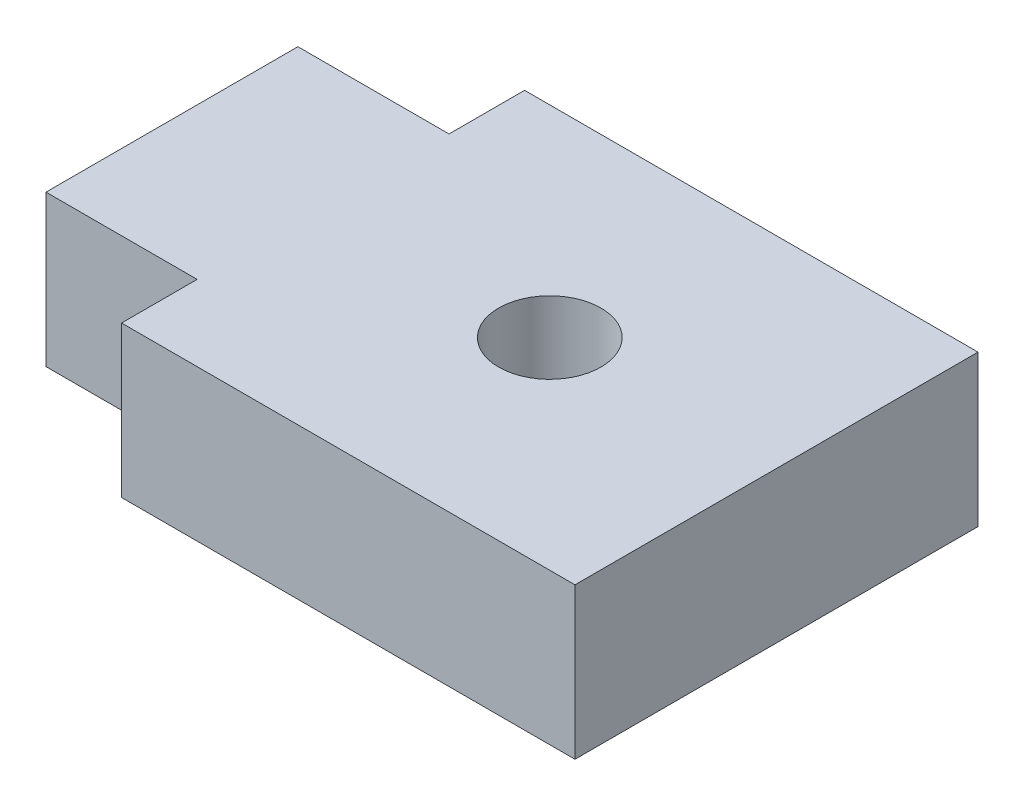
ISO-10303-21;
HEADER;
FILE_DESCRIPTION(('STEP AP214'),'2;1');
FILE_NAME('part.step','',(''),(''),'','','');
FILE_SCHEMA(('AUTOMOTIVE_DESIGN { 1 0 10303 214 1 1 1 1 }'));
ENDSEC;
DATA;
#1=APPLICATION_CONTEXT('core data for automotive mechanical design processes');
#2=APPLICATION_PROTOCOL_DEFINITION('international standard','automotive_design',2000,#1);
#3=PRODUCT_CONTEXT('',#1,'mechanical');
#4=PRODUCT('Part','Part','',(#3));
#5=PRODUCT_RELATED_PRODUCT_CATEGORY('part','',(#4));
#6=PRODUCT_DEFINITION_FORMATION('','',#4);
#7=PRODUCT_DEFINITION_CONTEXT('part definition',#1,'design');
#8=PRODUCT_DEFINITION('design','',#6,#7);
#9=PRODUCT_DEFINITION_SHAPE('','',#8);
#10=(LENGTH_UNIT() NAMED_UNIT(*) SI_UNIT(.MILLI.,.METRE.));
#11=(NAMED_UNIT(*) PLANE_ANGLE_UNIT() SI_UNIT($,.RADIAN.));
#12=(NAMED_UNIT(*) SI_UNIT($,.STERADIAN.) SOLID_ANGLE_UNIT());
#13=UNCERTAINTY_MEASURE_WITH_UNIT(LENGTH_MEASURE(1.E-05),#10,'distance_accuracy_value','');
#14=(GEOMETRIC_REPRESENTATION_CONTEXT(3) GLOBAL_UNCERTAINTY_ASSIGNED_CONTEXT((#13)) GLOBAL_UNIT_ASSIGNED_CONTEXT((#10,
#11,#12)) REPRESENTATION_CONTEXT('',''));
#15=CARTESIAN_POINT('',(0.,0.,0.));
#16=DIRECTION('',(0.,0.,1.));
#17=DIRECTION('',(1.,0.,0.));
#18=AXIS2_PLACEMENT_3D('',#15,#16,#17);
#19=CARTESIAN_POINT('',(-4.5,3.,0.));
#20=DIRECTION('',(-1.,0.,0.));
#21=DIRECTION('',(0.,0.,1.));
#22=AXIS2_PLACEMENT_3D('',#19,#20,#21);
#23=PLANE('',#22);
#24=DIRECTION('',(0.,0.,-1.));
#25=VECTOR('',#24,1.);
#26=CARTESIAN_POINT('',(-4.5,0.,0.));
#27=LINE('',#26,#25);
#28=CARTESIAN_POINT('',(-4.5,0.,-2.5));
#29=VERTEX_POINT('',#28);
#30=CARTESIAN_POINT('',(-4.5,0.,-4.));
#31=VERTEX_POINT('',#30);
#32=EDGE_CURVE('E57',#29,#31,#27,.T.);
#33=ORIENTED_EDGE('',*,*,#32,.F.);
#34=DIRECTION('',(0.,1.,0.));
#35=VECTOR('',#34,1.);
#36=CARTESIAN_POINT('',(-4.5,-5.8309518948453,-2.5));
#37=LINE('',#36,#35);
#38=CARTESIAN_POINT('',(-4.5,3.,-2.5));
#39=VERTEX_POINT('',#38);
#40=EDGE_CURVE('E52',#29,#39,#37,.T.);
#41=ORIENTED_EDGE('',*,*,#40,.T.);
#42=DIRECTION('',(0.,0.,-1.));
#43=VECTOR('',#42,1.);
#44=CARTESIAN_POINT('',(-4.5,3.,0.));
#45=LINE('',#44,#43);
#46=CARTESIAN_POINT('',(-4.5,3.,-4.));
#47=VERTEX_POINT('',#46);
#48=EDGE_CURVE('E124',#39,#47,#45,.T.);
#49=ORIENTED_EDGE('',*,*,#48,.T.);
#50=DIRECTION('',(0.,-1.,0.));
#51=VECTOR('',#50,1.);
#52=CARTESIAN_POINT('',(-4.5,3.,-4.));
#53=LINE('',#52,#51);
#54=EDGE_CURVE('E164',#47,#31,#53,.T.);
#55=ORIENTED_EDGE('',*,*,#54,.T.);
#56=EDGE_LOOP('',(#33,#41,#49,#55));
#57=FACE_BOUND('',#56,.T.);
#58=ADVANCED_FACE('F35',(#57),#23,.T.);
#59=CARTESIAN_POINT('',(0.,3.,4.));
#60=DIRECTION('',(0.,0.,-1.));
#61=DIRECTION('',(-1.,0.,0.));
#62=AXIS2_PLACEMENT_3D('',#59,#60,#61);
#63=PLANE('',#62);
#64=DIRECTION('',(1.,0.,0.));
#65=VECTOR('',#64,1.);
#66=CARTESIAN_POINT('',(0.,0.,4.));
#67=LINE('',#66,#65);
#68=CARTESIAN_POINT('',(-4.5,0.,4.));
#69=VERTEX_POINT('',#68);
#70=CARTESIAN_POINT('',(4.5,0.,4.));
#71=VERTEX_POINT('',#70);
#72=EDGE_CURVE('E147',#69,#71,#67,.T.);
#73=ORIENTED_EDGE('',*,*,#72,.T.);
#74=DIRECTION('',(0.,-1.,0.));
#75=VECTOR('',#74,1.);
#76=CARTESIAN_POINT('',(4.5,3.,4.));
#77=LINE('',#76,#75);
#78=CARTESIAN_POINT('',(4.5,3.,4.));
#79=VERTEX_POINT('',#78);
#80=EDGE_CURVE('E11',#79,#71,#77,.T.);
#81=ORIENTED_EDGE('',*,*,#80,.F.);
#82=DIRECTION('',(1.,0.,0.));
#83=VECTOR('',#82,1.);
#84=CARTESIAN_POINT('',(0.,3.,4.));
#85=LINE('',#84,#83);
#86=CARTESIAN_POINT('',(-4.5,3.,4.));
#87=VERTEX_POINT('',#86);
#88=EDGE_CURVE('E137',#87,#79,#85,.T.);
#89=ORIENTED_EDGE('',*,*,#88,.F.);
#90=DIRECTION('',(0.,-1.,0.));
#91=VECTOR('',#90,1.);
#92=CARTESIAN_POINT('',(-4.5,3.,4.));
#93=LINE('',#92,#91);
#94=EDGE_CURVE('E155',#87,#69,#93,.T.);
#95=ORIENTED_EDGE('',*,*,#94,.T.);
#96=EDGE_LOOP('',(#73,#81,#89,#95));
#97=FACE_BOUND('',#96,.T.);
#98=ADVANCED_FACE('F37',(#97),#63,.F.);
#99=CARTESIAN_POINT('',(4.5,3.,0.));
#100=DIRECTION('',(-1.,0.,0.));
#101=DIRECTION('',(0.,0.,1.));
#102=AXIS2_PLACEMENT_3D('',#99,#100,#101);
#103=PLANE('',#102);
#104=DIRECTION('',(0.,0.,-1.));
#105=VECTOR('',#104,1.);
#106=CARTESIAN_POINT('',(4.5,0.,0.));
#107=LINE('',#106,#105);
#108=CARTESIAN_POINT('',(4.5,0.,-4.));
#109=VERTEX_POINT('',#108);
#110=EDGE_CURVE('E174',#71,#109,#107,.T.);
#111=ORIENTED_EDGE('',*,*,#110,.T.);
#112=DIRECTION('',(0.,-1.,0.));
#113=VECTOR('',#112,1.);
#114=CARTESIAN_POINT('',(4.5,3.,-4.));
#115=LINE('',#114,#113);
#116=CARTESIAN_POINT('',(4.5,3.,-4.));
#117=VERTEX_POINT('',#116);
#118=EDGE_CURVE('E44',#117,#109,#115,.T.);
#119=ORIENTED_EDGE('',*,*,#118,.F.);
#120=DIRECTION('',(0.,0.,-1.));
#121=VECTOR('',#120,1.);
#122=CARTESIAN_POINT('',(4.5,3.,0.));
#123=LINE('',#122,#121);
#124=EDGE_CURVE('E139',#79,#117,#123,.T.);
#125=ORIENTED_EDGE('',*,*,#124,.F.);
#126=ORIENTED_EDGE('',*,*,#80,.T.);
#127=EDGE_LOOP('',(#111,#119,#125,#126));
#128=FACE_BOUND('',#127,.T.);
#129=ADVANCED_FACE('F175',(#128),#103,.F.);
#130=CARTESIAN_POINT('',(0.,3.,-4.));
#131=DIRECTION('',(0.,0.,-1.));
#132=DIRECTION('',(-1.,0.,0.));
#133=AXIS2_PLACEMENT_3D('',#130,#131,#132);
#134=PLANE('',#133);
#135=DIRECTION('',(1.,0.,0.));
#136=VECTOR('',#135,1.);
#137=CARTESIAN_POINT('',(0.,0.,-4.));
#138=LINE('',#137,#136);
#139=EDGE_CURVE('E158',#31,#109,#138,.T.);
#140=ORIENTED_EDGE('',*,*,#139,.F.);
#141=ORIENTED_EDGE('',*,*,#54,.F.);
#142=DIRECTION('',(1.,0.,0.));
#143=VECTOR('',#142,1.);
#144=CARTESIAN_POINT('',(0.,3.,-4.));
#145=LINE('',#144,#143);
#146=EDGE_CURVE('E142',#47,#117,#145,.T.);
#147=ORIENTED_EDGE('',*,*,#146,.T.);
#148=ORIENTED_EDGE('',*,*,#118,.T.);
#149=EDGE_LOOP('',(#140,#141,#147,#148));
#150=FACE_BOUND('',#149,.T.);
#151=ADVANCED_FACE('F170',(#150),#134,.T.);
#152=DIRECTION('',(0.,1.,0.));
#153=VECTOR('',#152,1.);
#154=CARTESIAN_POINT('',(-4.5,-5.8309518948453,2.5));
#155=LINE('',#154,#153);
#156=CARTESIAN_POINT('',(-4.5,0.,2.5));
#157=VERTEX_POINT('',#156);
#158=CARTESIAN_POINT('',(-4.5,3.,2.5));
#159=VERTEX_POINT('',#158);
#160=EDGE_CURVE('E194',#157,#159,#155,.T.);
#161=ORIENTED_EDGE('',*,*,#160,.F.);
#162=EDGE_CURVE('E140',#69,#157,#27,.T.);
#163=ORIENTED_EDGE('',*,*,#162,.F.);
#164=ORIENTED_EDGE('',*,*,#94,.F.);
#165=EDGE_CURVE('E153',#87,#159,#45,.T.);
#166=ORIENTED_EDGE('',*,*,#165,.T.);
#167=EDGE_LOOP('',(#161,#163,#164,#166));
#168=FACE_BOUND('',#167,.T.);
#169=ADVANCED_FACE('F207',(#168),#23,.T.);
#170=CARTESIAN_POINT('',(0.,3.,0.));
#171=DIRECTION('',(0.,1.,0.));
#172=DIRECTION('',(0.,0.,1.));
#173=AXIS2_PLACEMENT_3D('',#170,#171,#172);
#174=PLANE('',#173);
#175=CARTESIAN_POINT('',(0.,3.,0.));
#176=DIRECTION('',(0.,1.,0.));
#177=DIRECTION('',(0.,0.,1.));
#178=AXIS2_PLACEMENT_3D('',#175,#176,#177);
#179=CIRCLE('',#178,1.016);
#180=CARTESIAN_POINT('',(0.,3.,1.016));
#181=VERTEX_POINT('',#180);
#182=EDGE_CURVE('E127',#181,#181,#179,.T.);
#183=ORIENTED_EDGE('',*,*,#182,.F.);
#184=EDGE_LOOP('',(#183));
#185=FACE_BOUND('',#184,.T.);
#186=ORIENTED_EDGE('',*,*,#88,.T.);
#187=ORIENTED_EDGE('',*,*,#124,.T.);
#188=ORIENTED_EDGE('',*,*,#146,.F.);
#189=ORIENTED_EDGE('',*,*,#48,.F.);
#190=DIRECTION('',(-1.,0.,0.));
#191=VECTOR('',#190,1.);
#192=CARTESIAN_POINT('',(-7.5,3.,-2.5));
#193=LINE('',#192,#191);
#194=CARTESIAN_POINT('',(-7.5,3.,-2.5));
#195=VERTEX_POINT('',#194);
#196=EDGE_CURVE('E106',#39,#195,#193,.T.);
#197=ORIENTED_EDGE('',*,*,#196,.T.);
#198=DIRECTION('',(0.,0.,1.));
#199=VECTOR('',#198,1.);
#200=CARTESIAN_POINT('',(-7.5,3.,2.5));
#201=LINE('',#200,#199);
#202=CARTESIAN_POINT('',(-7.5,3.,2.5));
#203=VERTEX_POINT('',#202);
#204=EDGE_CURVE('E113',#195,#203,#201,.T.);
#205=ORIENTED_EDGE('',*,*,#204,.T.);
#206=DIRECTION('',(1.,0.,0.));
#207=VECTOR('',#206,1.);
#208=CARTESIAN_POINT('',(-7.5,3.,2.5));
#209=LINE('',#208,#207);
#210=EDGE_CURVE('E119',#203,#159,#209,.T.);
#211=ORIENTED_EDGE('',*,*,#210,.T.);
#212=ORIENTED_EDGE('',*,*,#165,.F.);
#213=EDGE_LOOP('',(#186,#187,#188,#189,#197,#205,#211,#212));
#214=FACE_BOUND('',#213,.T.);
#215=ADVANCED_FACE('F122',(#185,#214),#174,.T.);
#216=CARTESIAN_POINT('',(0.,0.,0.));
#217=DIRECTION('',(0.,1.,0.));
#218=DIRECTION('',(0.,0.,1.));
#219=AXIS2_PLACEMENT_3D('',#216,#217,#218);
#220=PLANE('',#219);
#221=CARTESIAN_POINT('',(0.,0.,0.));
#222=DIRECTION('',(0.,1.,0.));
#223=DIRECTION('',(0.,0.,1.));
#224=AXIS2_PLACEMENT_3D('',#221,#222,#223);
#225=CIRCLE('',#224,1.016);
#226=CARTESIAN_POINT('',(0.,0.,1.016));
#227=VERTEX_POINT('',#226);
#228=EDGE_CURVE('E39',#227,#227,#225,.T.);
#229=ORIENTED_EDGE('',*,*,#228,.T.);
#230=EDGE_LOOP('',(#229));
#231=FACE_BOUND('',#230,.T.);
#232=ORIENTED_EDGE('',*,*,#72,.F.);
#233=ORIENTED_EDGE('',*,*,#162,.T.);
#234=DIRECTION('',(-1.,0.,0.));
#235=VECTOR('',#234,1.);
#236=CARTESIAN_POINT('',(-7.5,0.,2.5));
#237=LINE('',#236,#235);
#238=CARTESIAN_POINT('',(-7.5,0.,2.5));
#239=VERTEX_POINT('',#238);
#240=EDGE_CURVE('E186',#157,#239,#237,.T.);
#241=ORIENTED_EDGE('',*,*,#240,.T.);
#242=DIRECTION('',(0.,0.,-1.));
#243=VECTOR('',#242,1.);
#244=CARTESIAN_POINT('',(-7.5,0.,2.5));
#245=LINE('',#244,#243);
#246=CARTESIAN_POINT('',(-7.5,0.,-2.5));
#247=VERTEX_POINT('',#246);
#248=EDGE_CURVE('E187',#239,#247,#245,.T.);
#249=ORIENTED_EDGE('',*,*,#248,.T.);
#250=DIRECTION('',(1.,0.,0.));
#251=VECTOR('',#250,1.);
#252=CARTESIAN_POINT('',(-7.5,0.,-2.5));
#253=LINE('',#252,#251);
#254=EDGE_CURVE('E107',#247,#29,#253,.T.);
#255=ORIENTED_EDGE('',*,*,#254,.T.);
#256=ORIENTED_EDGE('',*,*,#32,.T.);
#257=ORIENTED_EDGE('',*,*,#139,.T.);
#258=ORIENTED_EDGE('',*,*,#110,.F.);
#259=EDGE_LOOP('',(#232,#233,#241,#249,#255,#256,#257,#258));
#260=FACE_BOUND('',#259,.T.);
#261=ADVANCED_FACE('F180',(#231,#260),#220,.F.);
#262=CARTESIAN_POINT('',(-7.5,-5.8309518948453,2.5));
#263=DIRECTION('',(0.,0.,1.));
#264=DIRECTION('',(1.,0.,0.));
#265=AXIS2_PLACEMENT_3D('',#262,#263,#264);
#266=PLANE('',#265);
#267=ORIENTED_EDGE('',*,*,#240,.F.);
#268=ORIENTED_EDGE('',*,*,#160,.T.);
#269=ORIENTED_EDGE('',*,*,#210,.F.);
#270=DIRECTION('',(0.,1.,0.));
#271=VECTOR('',#270,1.);
#272=CARTESIAN_POINT('',(-7.5,-5.8309518948453,2.5));
#273=LINE('',#272,#271);
#274=EDGE_CURVE('E110',#239,#203,#273,.T.);
#275=ORIENTED_EDGE('',*,*,#274,.F.);
#276=EDGE_LOOP('',(#267,#268,#269,#275));
#277=FACE_BOUND('',#276,.T.);
#278=ADVANCED_FACE('F213',(#277),#266,.T.);
#279=CARTESIAN_POINT('',(-7.5,-5.8309518948453,2.5));
#280=DIRECTION('',(-1.,0.,0.));
#281=DIRECTION('',(0.,0.,1.));
#282=AXIS2_PLACEMENT_3D('',#279,#280,#281);
#283=PLANE('',#282);
#284=ORIENTED_EDGE('',*,*,#248,.F.);
#285=ORIENTED_EDGE('',*,*,#274,.T.);
#286=ORIENTED_EDGE('',*,*,#204,.F.);
#287=DIRECTION('',(0.,1.,0.));
#288=VECTOR('',#287,1.);
#289=CARTESIAN_POINT('',(-7.5,-5.8309518948453,-2.5));
#290=LINE('',#289,#288);
#291=EDGE_CURVE('E102',#247,#195,#290,.T.);
#292=ORIENTED_EDGE('',*,*,#291,.F.);
#293=EDGE_LOOP('',(#284,#285,#286,#292));
#294=FACE_BOUND('',#293,.T.);
#295=ADVANCED_FACE('F114',(#294),#283,.T.);
#296=CARTESIAN_POINT('',(-7.5,-5.8309518948453,-2.5));
#297=DIRECTION('',(0.,0.,-1.));
#298=DIRECTION('',(-1.,0.,0.));
#299=AXIS2_PLACEMENT_3D('',#296,#297,#298);
#300=PLANE('',#299);
#301=ORIENTED_EDGE('',*,*,#254,.F.);
#302=ORIENTED_EDGE('',*,*,#291,.T.);
#303=ORIENTED_EDGE('',*,*,#196,.F.);
#304=ORIENTED_EDGE('',*,*,#40,.F.);
#305=EDGE_LOOP('',(#301,#302,#303,#304));
#306=FACE_BOUND('',#305,.T.);
#307=ADVANCED_FACE('F104',(#306),#300,.T.);
#308=CARTESIAN_POINT('',(0.,-5.00000000001367E-05,0.));
#309=DIRECTION('',(0.,1.,0.));
#310=DIRECTION('',(0.,0.,1.));
#311=AXIS2_PLACEMENT_3D('',#308,#309,#310);
#312=CYLINDRICAL_SURFACE('',#311,1.016);
#313=ORIENTED_EDGE('',*,*,#182,.T.);
#314=EDGE_LOOP('',(#313));
#315=FACE_BOUND('',#314,.T.);
#316=ORIENTED_EDGE('',*,*,#228,.F.);
#317=EDGE_LOOP('',(#316));
#318=FACE_BOUND('',#317,.T.);
#319=ADVANCED_FACE('F203',(#315,#318),#312,.F.);
#320=CLOSED_SHELL('',(#58,#98,#129,#151,#169,#215,#261,#278,#295,#307,#319));
#321=MANIFOLD_SOLID_BREP('B2',#320);
#322=ADVANCED_BREP_SHAPE_REPRESENTATION('',(#18,#321),#14);
#323=SHAPE_DEFINITION_REPRESENTATION(#9,#322);
ENDSEC;
END-ISO-10303-21;
